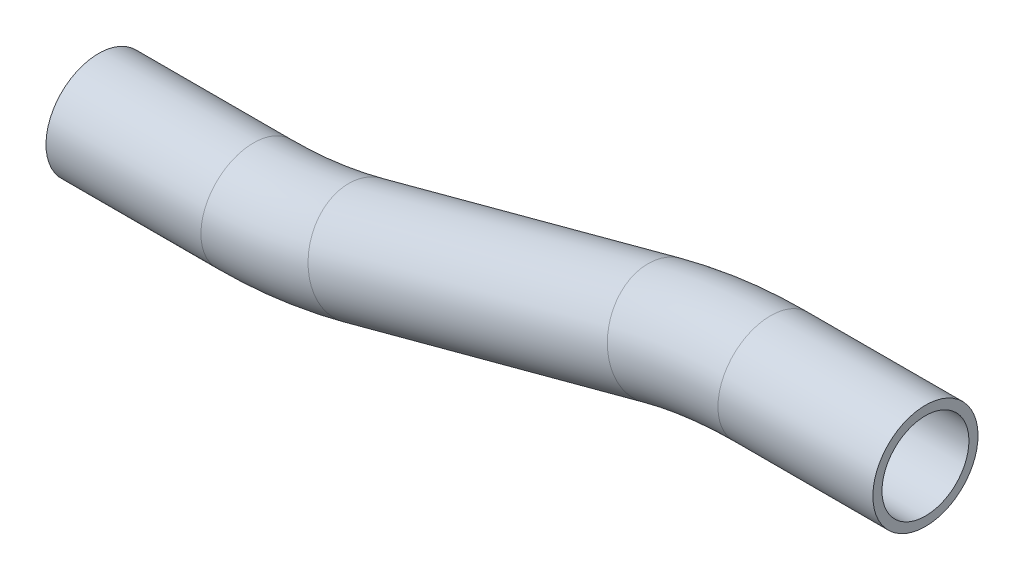
ISO-10303-21;
HEADER;
FILE_DESCRIPTION(('STEP AP214'),'2;1');
FILE_NAME('part.step','',(''),(''),'','','');
FILE_SCHEMA(('AUTOMOTIVE_DESIGN { 1 0 10303 214 1 1 1 1 }'));
ENDSEC;
DATA;
#1=APPLICATION_CONTEXT('core data for automotive mechanical design processes');
#2=APPLICATION_PROTOCOL_DEFINITION('international standard','automotive_design',2000,#1);
#3=PRODUCT_CONTEXT('',#1,'mechanical');
#4=PRODUCT('Part','Part','',(#3));
#5=PRODUCT_RELATED_PRODUCT_CATEGORY('part','',(#4));
#6=PRODUCT_DEFINITION_FORMATION('','',#4);
#7=PRODUCT_DEFINITION_CONTEXT('part definition',#1,'design');
#8=PRODUCT_DEFINITION('design','',#6,#7);
#9=PRODUCT_DEFINITION_SHAPE('','',#8);
#10=(LENGTH_UNIT() NAMED_UNIT(*) SI_UNIT(.MILLI.,.METRE.));
#11=(NAMED_UNIT(*) PLANE_ANGLE_UNIT() SI_UNIT($,.RADIAN.));
#12=(NAMED_UNIT(*) SI_UNIT($,.STERADIAN.) SOLID_ANGLE_UNIT());
#13=UNCERTAINTY_MEASURE_WITH_UNIT(LENGTH_MEASURE(1.E-05),#10,'distance_accuracy_value','');
#14=(GEOMETRIC_REPRESENTATION_CONTEXT(3) GLOBAL_UNCERTAINTY_ASSIGNED_CONTEXT((#13)) GLOBAL_UNIT_ASSIGNED_CONTEXT((#10,
#11,#12)) REPRESENTATION_CONTEXT('',''));
#15=CARTESIAN_POINT('',(0.,0.,0.));
#16=DIRECTION('',(0.,0.,1.));
#17=DIRECTION('',(1.,0.,0.));
#18=AXIS2_PLACEMENT_3D('',#15,#16,#17);
#19=CARTESIAN_POINT('',(28.0680796838404,0.,0.));
#20=DIRECTION('',(-1.,0.,0.));
#21=DIRECTION('',(0.,-1.,0.));
#22=AXIS2_PLACEMENT_3D('',#19,#20,#21);
#23=CYLINDRICAL_SURFACE('',#22,9.525);
#24=CARTESIAN_POINT('',(0.,0.,0.));
#25=DIRECTION('',(-1.,0.,0.));
#26=DIRECTION('',(0.,-1.,0.));
#27=AXIS2_PLACEMENT_3D('',#24,#25,#26);
#28=CIRCLE('',#27,9.525);
#29=CARTESIAN_POINT('',(0.,9.52499999999998,0.));
#30=VERTEX_POINT('',#29);
#31=EDGE_CURVE('E58',#30,#30,#28,.T.);
#32=ORIENTED_EDGE('',*,*,#31,.F.);
#33=EDGE_LOOP('',(#32));
#34=FACE_BOUND('',#33,.T.);
#35=CARTESIAN_POINT('',(28.0680796838404,0.,0.));
#36=DIRECTION('',(-1.,0.,0.));
#37=DIRECTION('',(0.,-1.,0.));
#38=AXIS2_PLACEMENT_3D('',#35,#36,#37);
#39=CIRCLE('',#38,9.525);
#40=CARTESIAN_POINT('',(28.0680796838404,-9.525,0.));
#41=VERTEX_POINT('',#40);
#42=EDGE_CURVE('E55',#41,#41,#39,.T.);
#43=ORIENTED_EDGE('',*,*,#42,.T.);
#44=EDGE_LOOP('',(#43));
#45=FACE_BOUND('',#44,.T.);
#46=ADVANCED_FACE('F34',(#34,#45),#23,.T.);
#47=CARTESIAN_POINT('',(0.,-76.2,0.));
#48=DIRECTION('',(0.,0.,1.));
#49=DIRECTION('',(1.,0.,0.));
#50=AXIS2_PLACEMENT_3D('',#47,#48,#49);
#51=TOROIDAL_SURFACE('',#50,76.2,9.525);
#52=CARTESIAN_POINT('',(-19.7220112368122,-2.59645203677303,0.));
#53=DIRECTION('',(-0.965925826289068,-0.258819045102522,0.));
#54=DIRECTION('',(0.258819045102522,-0.965925826289068,0.));
#55=AXIS2_PLACEMENT_3D('',#52,#53,#54);
#56=CIRCLE('',#55,9.525);
#57=CARTESIAN_POINT('',(-22.1872626414137,6.60399145863036,0.));
#58=VERTEX_POINT('',#57);
#59=EDGE_CURVE('E61',#58,#58,#56,.T.);
#60=CARTESIAN_POINT('',(0.,-76.2,0.));
#61=DIRECTION('',(0.,0.,1.));
#62=DIRECTION('',(1.,0.,0.));
#63=AXIS2_PLACEMENT_3D('',#60,#61,#62);
#64=CIRCLE('',#63,85.725);
#65=EDGE_CURVE('',#30,#58,#64,.T.);
#66=ORIENTED_EDGE('',*,*,#31,.T.);
#67=ORIENTED_EDGE('',*,*,#59,.F.);
#68=ORIENTED_EDGE('',*,*,#65,.T.);
#69=ORIENTED_EDGE('',*,*,#65,.F.);
#70=EDGE_LOOP('',(#66,#68,#67,#69));
#71=FACE_BOUND('',#70,.T.);
#72=ADVANCED_FACE('F80',(#71),#51,.T.);
#73=CARTESIAN_POINT('',(-19.7220112368122,-2.59645203677303,0.));
#74=DIRECTION('',(-0.965925826289068,-0.258819045102522,0.));
#75=DIRECTION('',(0.258819045102522,-0.965925826289068,0.));
#76=AXIS2_PLACEMENT_3D('',#73,#74,#75);
#77=CYLINDRICAL_SURFACE('',#76,9.525);
#78=CARTESIAN_POINT('',(-73.9453773587341,-17.1255592000392,0.));
#79=DIRECTION('',(-0.965925826289068,-0.258819045102522,0.));
#80=DIRECTION('',(0.258819045102522,-0.965925826289068,0.));
#81=AXIS2_PLACEMENT_3D('',#78,#79,#80);
#82=CIRCLE('',#81,9.525);
#83=CARTESIAN_POINT('',(-71.4801259541326,-26.3260026954426,0.));
#84=VERTEX_POINT('',#83);
#85=EDGE_CURVE('E63',#84,#84,#82,.T.);
#86=ORIENTED_EDGE('',*,*,#85,.F.);
#87=EDGE_LOOP('',(#86));
#88=FACE_BOUND('',#87,.T.);
#89=ORIENTED_EDGE('',*,*,#59,.T.);
#90=EDGE_LOOP('',(#89));
#91=FACE_BOUND('',#90,.T.);
#92=ADVANCED_FACE('F73',(#88,#91),#77,.T.);
#93=CARTESIAN_POINT('',(-93.6673885955463,56.4779887631878,0.));
#94=DIRECTION('',(0.,0.,-1.));
#95=DIRECTION('',(-1.,0.,0.));
#96=AXIS2_PLACEMENT_3D('',#93,#94,#95);
#97=TOROIDAL_SURFACE('',#96,76.2,9.525);
#98=CARTESIAN_POINT('',(-93.6673885955462,-19.7220112368122,0.));
#99=DIRECTION('',(-1.,0.,0.));
#100=DIRECTION('',(0.,-1.,0.));
#101=AXIS2_PLACEMENT_3D('',#98,#99,#100);
#102=CIRCLE('',#101,9.525);
#103=CARTESIAN_POINT('',(-93.6673885955462,-29.2470112368122,0.));
#104=VERTEX_POINT('',#103);
#105=EDGE_CURVE('E38',#104,#104,#102,.T.);
#106=CARTESIAN_POINT('',(-93.6673885955463,56.4779887631878,0.));
#107=DIRECTION('',(0.,0.,-1.));
#108=DIRECTION('',(-1.,0.,0.));
#109=AXIS2_PLACEMENT_3D('',#106,#107,#108);
#110=CIRCLE('',#109,85.725);
#111=EDGE_CURVE('',#84,#104,#110,.T.);
#112=ORIENTED_EDGE('',*,*,#85,.T.);
#113=ORIENTED_EDGE('',*,*,#105,.F.);
#114=ORIENTED_EDGE('',*,*,#111,.T.);
#115=ORIENTED_EDGE('',*,*,#111,.F.);
#116=EDGE_LOOP('',(#112,#114,#113,#115));
#117=FACE_BOUND('',#116,.T.);
#118=ADVANCED_FACE('F71',(#117),#97,.T.);
#119=CARTESIAN_POINT('',(-93.6673885955462,-19.7220112368122,0.));
#120=DIRECTION('',(-1.,0.,0.));
#121=DIRECTION('',(0.,0.,1.));
#122=AXIS2_PLACEMENT_3D('',#119,#120,#121);
#123=CYLINDRICAL_SURFACE('',#122,9.525);
#124=CARTESIAN_POINT('',(-121.735468279387,-19.7220112368122,0.));
#125=DIRECTION('',(-1.,0.,0.));
#126=DIRECTION('',(0.,-1.,0.));
#127=AXIS2_PLACEMENT_3D('',#124,#125,#126);
#128=CIRCLE('',#127,9.525);
#129=CARTESIAN_POINT('',(-121.735468279387,-29.2470112368122,0.));
#130=VERTEX_POINT('',#129);
#131=EDGE_CURVE('E51',#130,#130,#128,.T.);
#132=ORIENTED_EDGE('',*,*,#131,.F.);
#133=EDGE_LOOP('',(#132));
#134=FACE_BOUND('',#133,.T.);
#135=ORIENTED_EDGE('',*,*,#105,.T.);
#136=EDGE_LOOP('',(#135));
#137=FACE_BOUND('',#136,.T.);
#138=ADVANCED_FACE('F36',(#134,#137),#123,.T.);
#139=CARTESIAN_POINT('',(28.0680796838404,0.,0.));
#140=DIRECTION('',(-1.,0.,0.));
#141=DIRECTION('',(0.,-1.,0.));
#142=AXIS2_PLACEMENT_3D('',#139,#140,#141);
#143=PLANE('',#142);
#144=CARTESIAN_POINT('',(28.0680796838404,0.,0.));
#145=DIRECTION('',(-1.,0.,0.));
#146=DIRECTION('',(0.,-1.,0.));
#147=AXIS2_PLACEMENT_3D('',#144,#145,#146);
#148=CIRCLE('',#147,7.874);
#149=CARTESIAN_POINT('',(28.0680796838404,-7.874,0.));
#150=VERTEX_POINT('',#149);
#151=EDGE_CURVE('E54',#150,#150,#148,.F.);
#152=ORIENTED_EDGE('',*,*,#151,.F.);
#153=EDGE_LOOP('',(#152));
#154=FACE_BOUND('',#153,.T.);
#155=ORIENTED_EDGE('',*,*,#42,.F.);
#156=EDGE_LOOP('',(#155));
#157=FACE_BOUND('',#156,.T.);
#158=ADVANCED_FACE('F78',(#154,#157),#143,.F.);
#159=CARTESIAN_POINT('',(-121.735468279387,-19.7220112368122,0.));
#160=DIRECTION('',(-1.,0.,0.));
#161=DIRECTION('',(0.,-1.,0.));
#162=AXIS2_PLACEMENT_3D('',#159,#160,#161);
#163=PLANE('',#162);
#164=CARTESIAN_POINT('',(-121.735468279387,-19.7220112368122,0.));
#165=DIRECTION('',(-1.,0.,0.));
#166=DIRECTION('',(0.,-1.,0.));
#167=AXIS2_PLACEMENT_3D('',#164,#165,#166);
#168=CIRCLE('',#167,7.874);
#169=CARTESIAN_POINT('',(-121.735468279387,-27.5960112368122,0.));
#170=VERTEX_POINT('',#169);
#171=EDGE_CURVE('E10',#170,#170,#168,.F.);
#172=ORIENTED_EDGE('',*,*,#171,.T.);
#173=EDGE_LOOP('',(#172));
#174=FACE_BOUND('',#173,.T.);
#175=ORIENTED_EDGE('',*,*,#131,.T.);
#176=EDGE_LOOP('',(#175));
#177=FACE_BOUND('',#176,.T.);
#178=ADVANCED_FACE('F97',(#174,#177),#163,.T.);
#179=CARTESIAN_POINT('',(28.0680796838404,0.,0.));
#180=DIRECTION('',(-1.,0.,0.));
#181=DIRECTION('',(0.,-1.,0.));
#182=AXIS2_PLACEMENT_3D('',#179,#180,#181);
#183=CYLINDRICAL_SURFACE('',#182,7.874);
#184=CARTESIAN_POINT('',(0.,0.,0.));
#185=DIRECTION('',(-1.,0.,0.));
#186=DIRECTION('',(0.,-1.,0.));
#187=AXIS2_PLACEMENT_3D('',#184,#185,#186);
#188=CIRCLE('',#187,7.874);
#189=CARTESIAN_POINT('',(0.,7.87399999999996,0.));
#190=VERTEX_POINT('',#189);
#191=EDGE_CURVE('E195',#190,#190,#188,.F.);
#192=ORIENTED_EDGE('',*,*,#191,.F.);
#193=EDGE_LOOP('',(#192));
#194=FACE_BOUND('',#193,.T.);
#195=ORIENTED_EDGE('',*,*,#151,.T.);
#196=EDGE_LOOP('',(#195));
#197=FACE_BOUND('',#196,.T.);
#198=ADVANCED_FACE('F100',(#194,#197),#183,.F.);
#199=CARTESIAN_POINT('',(0.,-76.2,0.));
#200=DIRECTION('',(0.,0.,1.));
#201=DIRECTION('',(1.,0.,0.));
#202=AXIS2_PLACEMENT_3D('',#199,#200,#201);
#203=TOROIDAL_SURFACE('',#202,76.2,7.874);
#204=CARTESIAN_POINT('',(-19.7220112368122,-2.59645203677303,0.));
#205=DIRECTION('',(-0.965925826289068,-0.258819045102522,0.));
#206=DIRECTION('',(0.258819045102522,-0.965925826289068,0.));
#207=AXIS2_PLACEMENT_3D('',#204,#205,#206);
#208=CIRCLE('',#207,7.874);
#209=CARTESIAN_POINT('',(-21.7599523979494,5.00924791942708,0.));
#210=VERTEX_POINT('',#209);
#211=EDGE_CURVE('E194',#210,#210,#208,.F.);
#212=CARTESIAN_POINT('',(0.,-76.2,0.));
#213=DIRECTION('',(0.,0.,1.));
#214=DIRECTION('',(1.,0.,0.));
#215=AXIS2_PLACEMENT_3D('',#212,#213,#214);
#216=CIRCLE('',#215,84.074);
#217=EDGE_CURVE('',#190,#210,#216,.T.);
#218=ORIENTED_EDGE('',*,*,#191,.T.);
#219=ORIENTED_EDGE('',*,*,#211,.F.);
#220=ORIENTED_EDGE('',*,*,#217,.T.);
#221=ORIENTED_EDGE('',*,*,#217,.F.);
#222=EDGE_LOOP('',(#218,#220,#219,#221));
#223=FACE_BOUND('',#222,.T.);
#224=ADVANCED_FACE('F157',(#223),#203,.F.);
#225=CARTESIAN_POINT('',(-19.7220112368122,-2.59645203677303,0.));
#226=DIRECTION('',(-0.965925826289068,-0.258819045102522,0.));
#227=DIRECTION('',(0.258819045102522,-0.965925826289068,0.));
#228=AXIS2_PLACEMENT_3D('',#225,#226,#227);
#229=CYLINDRICAL_SURFACE('',#228,7.874);
#230=CARTESIAN_POINT('',(-73.9453773587341,-17.1255592000392,0.));
#231=DIRECTION('',(-0.965925826289068,-0.258819045102522,0.));
#232=DIRECTION('',(0.258819045102522,-0.965925826289068,0.));
#233=AXIS2_PLACEMENT_3D('',#230,#231,#232);
#234=CIRCLE('',#233,7.874);
#235=CARTESIAN_POINT('',(-71.9074361975969,-24.7312591562393,0.));
#236=VERTEX_POINT('',#235);
#237=EDGE_CURVE('E47',#236,#236,#234,.F.);
#238=ORIENTED_EDGE('',*,*,#237,.F.);
#239=EDGE_LOOP('',(#238));
#240=FACE_BOUND('',#239,.T.);
#241=ORIENTED_EDGE('',*,*,#211,.T.);
#242=EDGE_LOOP('',(#241));
#243=FACE_BOUND('',#242,.T.);
#244=ADVANCED_FACE('F91',(#240,#243),#229,.F.);
#245=CARTESIAN_POINT('',(-93.6673885955463,56.4779887631878,0.));
#246=DIRECTION('',(0.,0.,-1.));
#247=DIRECTION('',(-1.,0.,0.));
#248=AXIS2_PLACEMENT_3D('',#245,#246,#247);
#249=TOROIDAL_SURFACE('',#248,76.2,7.874);
#250=CARTESIAN_POINT('',(-93.6673885955462,-19.7220112368122,0.));
#251=DIRECTION('',(-1.,0.,0.));
#252=DIRECTION('',(0.,-1.,0.));
#253=AXIS2_PLACEMENT_3D('',#250,#251,#252);
#254=CIRCLE('',#253,7.874);
#255=CARTESIAN_POINT('',(-93.6673885955462,-27.5960112368122,0.));
#256=VERTEX_POINT('',#255);
#257=EDGE_CURVE('E42',#256,#256,#254,.F.);
#258=CARTESIAN_POINT('',(-93.6673885955463,56.4779887631878,0.));
#259=DIRECTION('',(0.,0.,-1.));
#260=DIRECTION('',(-1.,0.,0.));
#261=AXIS2_PLACEMENT_3D('',#258,#259,#260);
#262=CIRCLE('',#261,84.074);
#263=EDGE_CURVE('',#236,#256,#262,.T.);
#264=ORIENTED_EDGE('',*,*,#237,.T.);
#265=ORIENTED_EDGE('',*,*,#257,.F.);
#266=ORIENTED_EDGE('',*,*,#263,.T.);
#267=ORIENTED_EDGE('',*,*,#263,.F.);
#268=EDGE_LOOP('',(#264,#266,#265,#267));
#269=FACE_BOUND('',#268,.T.);
#270=ADVANCED_FACE('F85',(#269),#249,.F.);
#271=CARTESIAN_POINT('',(-93.6673885955462,-19.7220112368122,0.));
#272=DIRECTION('',(-1.,0.,0.));
#273=DIRECTION('',(0.,0.,1.));
#274=AXIS2_PLACEMENT_3D('',#271,#272,#273);
#275=CYLINDRICAL_SURFACE('',#274,7.874);
#276=ORIENTED_EDGE('',*,*,#171,.F.);
#277=EDGE_LOOP('',(#276));
#278=FACE_BOUND('',#277,.T.);
#279=ORIENTED_EDGE('',*,*,#257,.T.);
#280=EDGE_LOOP('',(#279));
#281=FACE_BOUND('',#280,.T.);
#282=ADVANCED_FACE('F83',(#278,#281),#275,.F.);
#283=CLOSED_SHELL('',(#46,#72,#92,#118,#138,#158,#178,#198,#224,#244,#270,#282));
#284=MANIFOLD_SOLID_BREP('B2',#283);
#285=ADVANCED_BREP_SHAPE_REPRESENTATION('',(#18,#284),#14);
#286=SHAPE_DEFINITION_REPRESENTATION(#9,#285);
ENDSEC;
END-ISO-10303-21;
